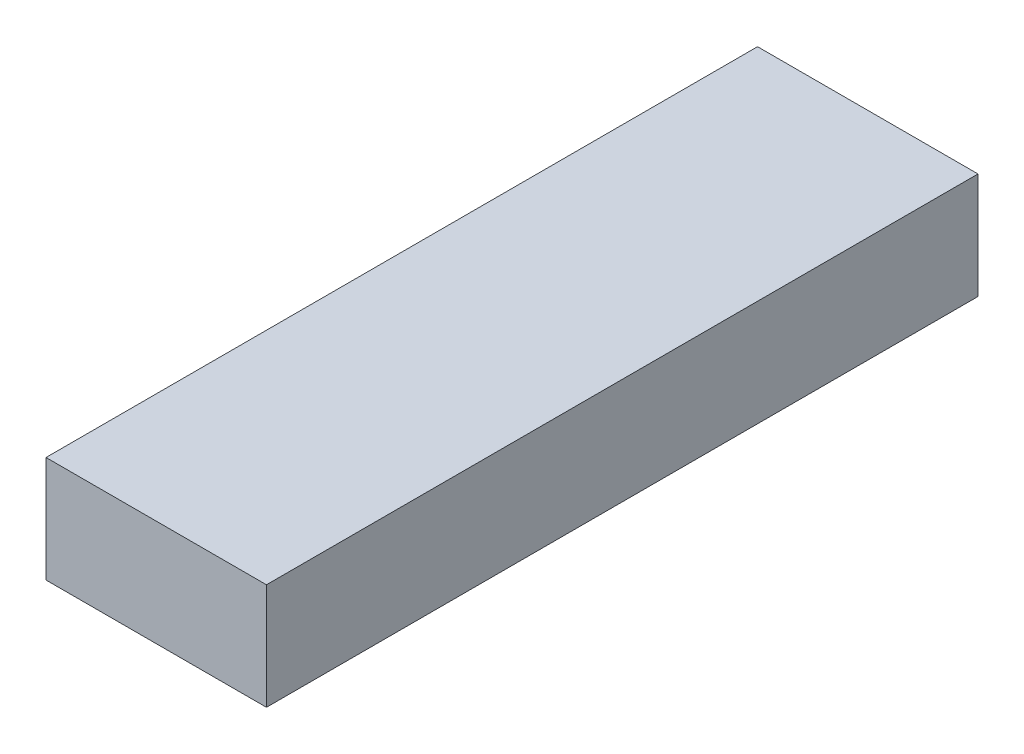
ISO-10303-21;
HEADER;
FILE_DESCRIPTION(('STEP AP214'),'2;1');
FILE_NAME('part.step','',(''),(''),'','','');
FILE_SCHEMA(('AUTOMOTIVE_DESIGN { 1 0 10303 214 1 1 1 1 }'));
ENDSEC;
DATA;
#1=APPLICATION_CONTEXT('core data for automotive mechanical design processes');
#2=APPLICATION_PROTOCOL_DEFINITION('international standard','automotive_design',2000,#1);
#3=PRODUCT_CONTEXT('',#1,'mechanical');
#4=PRODUCT('Part','Part','',(#3));
#5=PRODUCT_RELATED_PRODUCT_CATEGORY('part','',(#4));
#6=PRODUCT_DEFINITION_FORMATION('','',#4);
#7=PRODUCT_DEFINITION_CONTEXT('part definition',#1,'design');
#8=PRODUCT_DEFINITION('design','',#6,#7);
#9=PRODUCT_DEFINITION_SHAPE('','',#8);
#10=(LENGTH_UNIT() NAMED_UNIT(*) SI_UNIT(.MILLI.,.METRE.));
#11=(NAMED_UNIT(*) PLANE_ANGLE_UNIT() SI_UNIT($,.RADIAN.));
#12=(NAMED_UNIT(*) SI_UNIT($,.STERADIAN.) SOLID_ANGLE_UNIT());
#13=UNCERTAINTY_MEASURE_WITH_UNIT(LENGTH_MEASURE(1.E-05),#10,'distance_accuracy_value','');
#14=(GEOMETRIC_REPRESENTATION_CONTEXT(3) GLOBAL_UNCERTAINTY_ASSIGNED_CONTEXT((#13)) GLOBAL_UNIT_ASSIGNED_CONTEXT((#10,
#11,#12)) REPRESENTATION_CONTEXT('',''));
#15=CARTESIAN_POINT('',(0.,0.,0.));
#16=DIRECTION('',(0.,0.,1.));
#17=DIRECTION('',(1.,0.,0.));
#18=AXIS2_PLACEMENT_3D('',#15,#16,#17);
#19=CARTESIAN_POINT('',(24.003,-11.557,-77.47));
#20=DIRECTION('',(1.,0.,0.));
#21=DIRECTION('',(0.,0.,-1.));
#22=AXIS2_PLACEMENT_3D('',#19,#20,#21);
#23=PLANE('',#22);
#24=DIRECTION('',(0.,0.,1.));
#25=VECTOR('',#24,1.);
#26=CARTESIAN_POINT('',(24.003,11.557,-77.47));
#27=LINE('',#26,#25);
#28=CARTESIAN_POINT('',(24.003,11.557,-77.47));
#29=VERTEX_POINT('',#28);
#30=CARTESIAN_POINT('',(24.003,11.557,77.47));
#31=VERTEX_POINT('',#30);
#32=EDGE_CURVE('E37',#29,#31,#27,.T.);
#33=ORIENTED_EDGE('',*,*,#32,.T.);
#34=DIRECTION('',(0.,1.,0.));
#35=VECTOR('',#34,1.);
#36=CARTESIAN_POINT('',(24.003,-11.557,77.47));
#37=LINE('',#36,#35);
#38=CARTESIAN_POINT('',(24.003,-11.557,77.47));
#39=VERTEX_POINT('',#38);
#40=EDGE_CURVE('E74',#39,#31,#37,.T.);
#41=ORIENTED_EDGE('',*,*,#40,.F.);
#42=DIRECTION('',(0.,0.,1.));
#43=VECTOR('',#42,1.);
#44=CARTESIAN_POINT('',(24.003,-11.557,-77.47));
#45=LINE('',#44,#43);
#46=CARTESIAN_POINT('',(24.003,-11.557,-77.47));
#47=VERTEX_POINT('',#46);
#48=EDGE_CURVE('E11',#47,#39,#45,.T.);
#49=ORIENTED_EDGE('',*,*,#48,.F.);
#50=DIRECTION('',(0.,1.,0.));
#51=VECTOR('',#50,1.);
#52=CARTESIAN_POINT('',(24.003,-11.557,-77.47));
#53=LINE('',#52,#51);
#54=EDGE_CURVE('E75',#47,#29,#53,.T.);
#55=ORIENTED_EDGE('',*,*,#54,.T.);
#56=EDGE_LOOP('',(#33,#41,#49,#55));
#57=FACE_BOUND('',#56,.T.);
#58=ADVANCED_FACE('F34',(#57),#23,.T.);
#59=CARTESIAN_POINT('',(-24.003,-11.557,-77.47));
#60=DIRECTION('',(0.,-1.,0.));
#61=DIRECTION('',(0.,0.,-1.));
#62=AXIS2_PLACEMENT_3D('',#59,#60,#61);
#63=PLANE('',#62);
#64=ORIENTED_EDGE('',*,*,#48,.T.);
#65=DIRECTION('',(1.,0.,0.));
#66=VECTOR('',#65,1.);
#67=CARTESIAN_POINT('',(-24.003,-11.557,77.47));
#68=LINE('',#67,#66);
#69=CARTESIAN_POINT('',(-24.003,-11.557,77.47));
#70=VERTEX_POINT('',#69);
#71=EDGE_CURVE('E91',#70,#39,#68,.T.);
#72=ORIENTED_EDGE('',*,*,#71,.F.);
#73=DIRECTION('',(0.,0.,1.));
#74=VECTOR('',#73,1.);
#75=CARTESIAN_POINT('',(-24.003,-11.557,-77.47));
#76=LINE('',#75,#74);
#77=CARTESIAN_POINT('',(-24.003,-11.557,-77.47));
#78=VERTEX_POINT('',#77);
#79=EDGE_CURVE('E42',#78,#70,#76,.T.);
#80=ORIENTED_EDGE('',*,*,#79,.F.);
#81=DIRECTION('',(1.,0.,0.));
#82=VECTOR('',#81,1.);
#83=CARTESIAN_POINT('',(-24.003,-11.557,-77.47));
#84=LINE('',#83,#82);
#85=EDGE_CURVE('E80',#78,#47,#84,.T.);
#86=ORIENTED_EDGE('',*,*,#85,.T.);
#87=EDGE_LOOP('',(#64,#72,#80,#86));
#88=FACE_BOUND('',#87,.T.);
#89=ADVANCED_FACE('F106',(#88),#63,.T.);
#90=CARTESIAN_POINT('',(-24.003,-11.557,-77.47));
#91=DIRECTION('',(-1.,0.,0.));
#92=DIRECTION('',(0.,0.,1.));
#93=AXIS2_PLACEMENT_3D('',#90,#91,#92);
#94=PLANE('',#93);
#95=ORIENTED_EDGE('',*,*,#79,.T.);
#96=DIRECTION('',(0.,-1.,0.));
#97=VECTOR('',#96,1.);
#98=CARTESIAN_POINT('',(-24.003,-11.557,77.47));
#99=LINE('',#98,#97);
#100=CARTESIAN_POINT('',(-24.003,11.557,77.47));
#101=VERTEX_POINT('',#100);
#102=EDGE_CURVE('E87',#101,#70,#99,.T.);
#103=ORIENTED_EDGE('',*,*,#102,.F.);
#104=DIRECTION('',(0.,0.,1.));
#105=VECTOR('',#104,1.);
#106=CARTESIAN_POINT('',(-24.003,11.557,-77.47));
#107=LINE('',#106,#105);
#108=CARTESIAN_POINT('',(-24.003,11.557,-77.47));
#109=VERTEX_POINT('',#108);
#110=EDGE_CURVE('E79',#109,#101,#107,.T.);
#111=ORIENTED_EDGE('',*,*,#110,.F.);
#112=DIRECTION('',(0.,-1.,0.));
#113=VECTOR('',#112,1.);
#114=CARTESIAN_POINT('',(-24.003,-11.557,-77.47));
#115=LINE('',#114,#113);
#116=EDGE_CURVE('E99',#109,#78,#115,.T.);
#117=ORIENTED_EDGE('',*,*,#116,.T.);
#118=EDGE_LOOP('',(#95,#103,#111,#117));
#119=FACE_BOUND('',#118,.T.);
#120=ADVANCED_FACE('F103',(#119),#94,.T.);
#121=CARTESIAN_POINT('',(-24.003,11.557,-77.47));
#122=DIRECTION('',(0.,1.,0.));
#123=DIRECTION('',(0.,0.,1.));
#124=AXIS2_PLACEMENT_3D('',#121,#122,#123);
#125=PLANE('',#124);
#126=ORIENTED_EDGE('',*,*,#110,.T.);
#127=DIRECTION('',(-1.,0.,0.));
#128=VECTOR('',#127,1.);
#129=CARTESIAN_POINT('',(-24.003,11.557,77.47));
#130=LINE('',#129,#128);
#131=EDGE_CURVE('E82',#31,#101,#130,.T.);
#132=ORIENTED_EDGE('',*,*,#131,.F.);
#133=ORIENTED_EDGE('',*,*,#32,.F.);
#134=DIRECTION('',(-1.,0.,0.));
#135=VECTOR('',#134,1.);
#136=CARTESIAN_POINT('',(-24.003,11.557,-77.47));
#137=LINE('',#136,#135);
#138=EDGE_CURVE('E97',#29,#109,#137,.T.);
#139=ORIENTED_EDGE('',*,*,#138,.T.);
#140=EDGE_LOOP('',(#126,#132,#133,#139));
#141=FACE_BOUND('',#140,.T.);
#142=ADVANCED_FACE('F83',(#141),#125,.T.);
#143=CARTESIAN_POINT('',(0.,0.,-77.47));
#144=DIRECTION('',(0.,0.,-1.));
#145=DIRECTION('',(-1.,0.,0.));
#146=AXIS2_PLACEMENT_3D('',#143,#144,#145);
#147=PLANE('',#146);
#148=ORIENTED_EDGE('',*,*,#54,.F.);
#149=ORIENTED_EDGE('',*,*,#85,.F.);
#150=ORIENTED_EDGE('',*,*,#116,.F.);
#151=ORIENTED_EDGE('',*,*,#138,.F.);
#152=EDGE_LOOP('',(#148,#149,#150,#151));
#153=FACE_BOUND('',#152,.T.);
#154=ADVANCED_FACE('F108',(#153),#147,.T.);
#155=CARTESIAN_POINT('',(0.,0.,77.47));
#156=DIRECTION('',(0.,0.,-1.));
#157=DIRECTION('',(-1.,0.,0.));
#158=AXIS2_PLACEMENT_3D('',#155,#156,#157);
#159=PLANE('',#158);
#160=ORIENTED_EDGE('',*,*,#40,.T.);
#161=ORIENTED_EDGE('',*,*,#131,.T.);
#162=ORIENTED_EDGE('',*,*,#102,.T.);
#163=ORIENTED_EDGE('',*,*,#71,.T.);
#164=EDGE_LOOP('',(#160,#161,#162,#163));
#165=FACE_BOUND('',#164,.T.);
#166=ADVANCED_FACE('F90',(#165),#159,.F.);
#167=CLOSED_SHELL('',(#58,#89,#120,#142,#154,#166));
#168=MANIFOLD_SOLID_BREP('B2',#167);
#169=ADVANCED_BREP_SHAPE_REPRESENTATION('',(#18,#168),#14);
#170=SHAPE_DEFINITION_REPRESENTATION(#9,#169);
ENDSEC;
END-ISO-10303-21;
